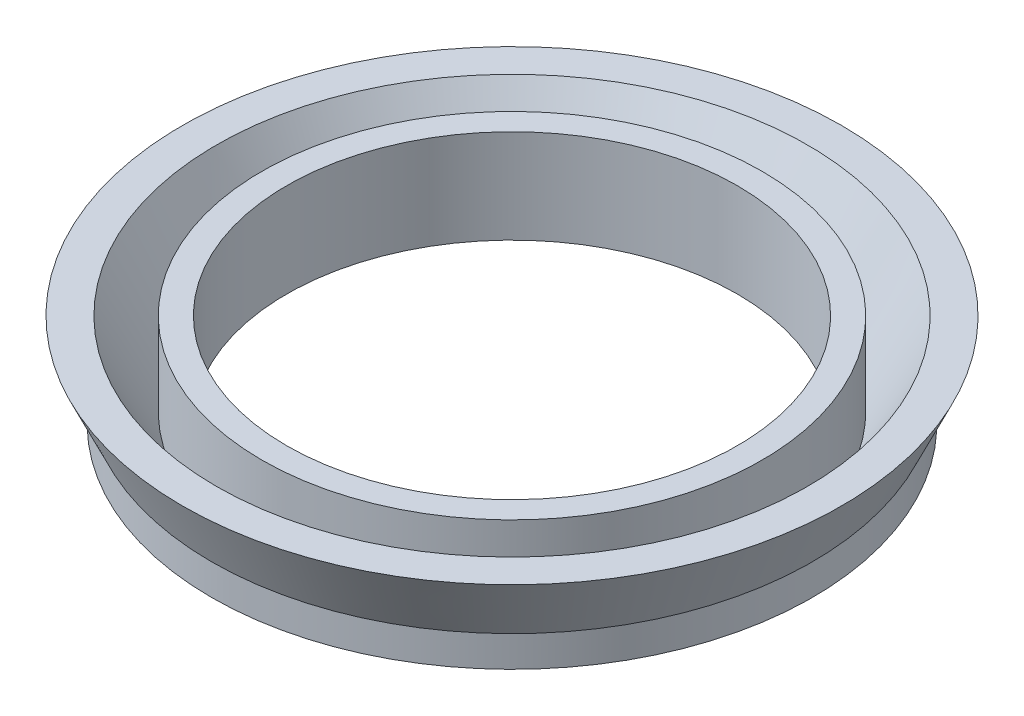
ISO-10303-21;
HEADER;
FILE_DESCRIPTION(('STEP AP214'),'2;1');
FILE_NAME('part.step','',(''),(''),'','','');
FILE_SCHEMA(('AUTOMOTIVE_DESIGN { 1 0 10303 214 1 1 1 1 }'));
ENDSEC;
DATA;
#1=APPLICATION_CONTEXT('core data for automotive mechanical design processes');
#2=APPLICATION_PROTOCOL_DEFINITION('international standard','automotive_design',2000,#1);
#3=PRODUCT_CONTEXT('',#1,'mechanical');
#4=PRODUCT('Part','Part','',(#3));
#5=PRODUCT_RELATED_PRODUCT_CATEGORY('part','',(#4));
#6=PRODUCT_DEFINITION_FORMATION('','',#4);
#7=PRODUCT_DEFINITION_CONTEXT('part definition',#1,'design');
#8=PRODUCT_DEFINITION('design','',#6,#7);
#9=PRODUCT_DEFINITION_SHAPE('','',#8);
#10=(LENGTH_UNIT() NAMED_UNIT(*) SI_UNIT(.MILLI.,.METRE.));
#11=(NAMED_UNIT(*) PLANE_ANGLE_UNIT() SI_UNIT($,.RADIAN.));
#12=(NAMED_UNIT(*) SI_UNIT($,.STERADIAN.) SOLID_ANGLE_UNIT());
#13=UNCERTAINTY_MEASURE_WITH_UNIT(LENGTH_MEASURE(1.E-05),#10,'distance_accuracy_value','');
#14=(GEOMETRIC_REPRESENTATION_CONTEXT(3) GLOBAL_UNCERTAINTY_ASSIGNED_CONTEXT((#13)) GLOBAL_UNIT_ASSIGNED_CONTEXT((#10,
#11,#12)) REPRESENTATION_CONTEXT('',''));
#15=CARTESIAN_POINT('',(0.,0.,0.));
#16=DIRECTION('',(0.,0.,1.));
#17=DIRECTION('',(1.,0.,0.));
#18=AXIS2_PLACEMENT_3D('',#15,#16,#17);
#19=CARTESIAN_POINT('',(0.,18.7428571428571,0.));
#20=DIRECTION('',(0.,1.,0.));
#21=DIRECTION('',(0.,0.,1.));
#22=AXIS2_PLACEMENT_3D('',#19,#20,#21);
#23=CYLINDRICAL_SURFACE('',#22,12.);
#24=CARTESIAN_POINT('',(0.,0.,0.));
#25=DIRECTION('',(0.,1.,0.));
#26=DIRECTION('',(0.,0.,1.));
#27=AXIS2_PLACEMENT_3D('',#24,#25,#26);
#28=CIRCLE('',#27,12.);
#29=CARTESIAN_POINT('',(0.,0.,12.));
#30=VERTEX_POINT('',#29);
#31=EDGE_CURVE('E59',#30,#30,#28,.T.);
#32=ORIENTED_EDGE('',*,*,#31,.F.);
#33=EDGE_LOOP('',(#32));
#34=FACE_BOUND('',#33,.T.);
#35=CARTESIAN_POINT('',(0.,5.,0.));
#36=DIRECTION('',(0.,1.,0.));
#37=DIRECTION('',(0.,0.,1.));
#38=AXIS2_PLACEMENT_3D('',#35,#36,#37);
#39=CIRCLE('',#38,12.);
#40=CARTESIAN_POINT('',(0.,5.,12.));
#41=VERTEX_POINT('',#40);
#42=EDGE_CURVE('E10',#41,#41,#39,.T.);
#43=ORIENTED_EDGE('',*,*,#42,.T.);
#44=EDGE_LOOP('',(#43));
#45=FACE_BOUND('',#44,.T.);
#46=ADVANCED_FACE('F31',(#34,#45),#23,.F.);
#47=CARTESIAN_POINT('',(12.,5.,0.));
#48=DIRECTION('',(0.,-1.,0.));
#49=DIRECTION('',(0.,0.,-1.));
#50=AXIS2_PLACEMENT_3D('',#47,#48,#49);
#51=PLANE('',#50);
#52=ORIENTED_EDGE('',*,*,#42,.F.);
#53=EDGE_LOOP('',(#52));
#54=FACE_BOUND('',#53,.T.);
#55=CARTESIAN_POINT('',(0.,5.,0.));
#56=DIRECTION('',(0.,1.,0.));
#57=DIRECTION('',(0.,0.,1.));
#58=AXIS2_PLACEMENT_3D('',#55,#56,#57);
#59=CIRCLE('',#58,13.3224191440759);
#60=CARTESIAN_POINT('',(0.,5.,13.3224191440759));
#61=VERTEX_POINT('',#60);
#62=EDGE_CURVE('E37',#61,#61,#59,.T.);
#63=ORIENTED_EDGE('',*,*,#62,.T.);
#64=EDGE_LOOP('',(#63));
#65=FACE_BOUND('',#64,.T.);
#66=ADVANCED_FACE('F66',(#54,#65),#51,.F.);
#67=CARTESIAN_POINT('',(0.,18.7428571428571,0.));
#68=DIRECTION('',(0.,1.,0.));
#69=DIRECTION('',(0.,0.,1.));
#70=AXIS2_PLACEMENT_3D('',#67,#68,#69);
#71=CYLINDRICAL_SURFACE('',#70,13.3224191440759);
#72=ORIENTED_EDGE('',*,*,#62,.F.);
#73=EDGE_LOOP('',(#72));
#74=FACE_BOUND('',#73,.T.);
#75=CARTESIAN_POINT('',(0.,0.563237403783234,0.));
#76=DIRECTION('',(0.,1.,0.));
#77=DIRECTION('',(0.,0.,1.));
#78=AXIS2_PLACEMENT_3D('',#75,#76,#77);
#79=CIRCLE('',#78,13.3224191440759);
#80=CARTESIAN_POINT('',(0.,0.563237403783234,13.3224191440759));
#81=VERTEX_POINT('',#80);
#82=EDGE_CURVE('E41',#81,#81,#79,.T.);
#83=ORIENTED_EDGE('',*,*,#82,.T.);
#84=EDGE_LOOP('',(#83));
#85=FACE_BOUND('',#84,.T.);
#86=ADVANCED_FACE('F70',(#74,#85),#71,.T.);
#87=CARTESIAN_POINT('',(0.,5.,0.));
#88=DIRECTION('',(0.,1.,0.));
#89=DIRECTION('',(0.,0.,1.));
#90=AXIS2_PLACEMENT_3D('',#87,#88,#89);
#91=CONICAL_SURFACE('',#90,15.7470422278368,0.50014035459895);
#92=ORIENTED_EDGE('',*,*,#82,.F.);
#93=EDGE_LOOP('',(#92));
#94=FACE_BOUND('',#93,.T.);
#95=CARTESIAN_POINT('',(0.,5.,0.));
#96=DIRECTION('',(0.,1.,0.));
#97=DIRECTION('',(0.,0.,1.));
#98=AXIS2_PLACEMENT_3D('',#95,#96,#97);
#99=CIRCLE('',#98,15.7470422278368);
#100=CARTESIAN_POINT('',(0.,5.,15.7470422278368));
#101=VERTEX_POINT('',#100);
#102=EDGE_CURVE('E45',#101,#101,#99,.T.);
#103=ORIENTED_EDGE('',*,*,#102,.T.);
#104=EDGE_LOOP('',(#103));
#105=FACE_BOUND('',#104,.T.);
#106=ADVANCED_FACE('F75',(#94,#105),#91,.F.);
#107=CARTESIAN_POINT('',(17.5524972748656,5.,0.));
#108=DIRECTION('',(0.,-1.,0.));
#109=DIRECTION('',(0.,0.,-1.));
#110=AXIS2_PLACEMENT_3D('',#107,#108,#109);
#111=PLANE('',#110);
#112=ORIENTED_EDGE('',*,*,#102,.F.);
#113=EDGE_LOOP('',(#112));
#114=FACE_BOUND('',#113,.T.);
#115=CARTESIAN_POINT('',(0.,5.,0.));
#116=DIRECTION('',(0.,1.,0.));
#117=DIRECTION('',(0.,0.,1.));
#118=AXIS2_PLACEMENT_3D('',#115,#116,#117);
#119=CIRCLE('',#118,17.5524972748656);
#120=CARTESIAN_POINT('',(0.,5.,17.5524972748656));
#121=VERTEX_POINT('',#120);
#122=EDGE_CURVE('E50',#121,#121,#119,.T.);
#123=ORIENTED_EDGE('',*,*,#122,.T.);
#124=EDGE_LOOP('',(#123));
#125=FACE_BOUND('',#124,.T.);
#126=ADVANCED_FACE('F81',(#114,#125),#111,.F.);
#127=CARTESIAN_POINT('',(0.,1.64571428571429,0.));
#128=DIRECTION('',(0.,1.,0.));
#129=DIRECTION('',(0.,0.,1.));
#130=AXIS2_PLACEMENT_3D('',#127,#128,#129);
#131=CONICAL_SURFACE('',#130,16.,0.433480139843868);
#132=ORIENTED_EDGE('',*,*,#122,.F.);
#133=EDGE_LOOP('',(#132));
#134=FACE_BOUND('',#133,.T.);
#135=CARTESIAN_POINT('',(0.,1.64571428571429,0.));
#136=DIRECTION('',(0.,1.,0.));
#137=DIRECTION('',(0.,0.,1.));
#138=AXIS2_PLACEMENT_3D('',#135,#136,#137);
#139=CIRCLE('',#138,16.);
#140=CARTESIAN_POINT('',(0.,1.64571428571429,16.));
#141=VERTEX_POINT('',#140);
#142=EDGE_CURVE('E53',#141,#141,#139,.T.);
#143=ORIENTED_EDGE('',*,*,#142,.T.);
#144=EDGE_LOOP('',(#143));
#145=FACE_BOUND('',#144,.T.);
#146=ADVANCED_FACE('F85',(#134,#145),#131,.T.);
#147=CARTESIAN_POINT('',(0.,18.7428571428571,0.));
#148=DIRECTION('',(0.,1.,0.));
#149=DIRECTION('',(0.,0.,1.));
#150=AXIS2_PLACEMENT_3D('',#147,#148,#149);
#151=CYLINDRICAL_SURFACE('',#150,16.);
#152=ORIENTED_EDGE('',*,*,#142,.F.);
#153=EDGE_LOOP('',(#152));
#154=FACE_BOUND('',#153,.T.);
#155=CARTESIAN_POINT('',(0.,0.,0.));
#156=DIRECTION('',(0.,1.,0.));
#157=DIRECTION('',(0.,0.,1.));
#158=AXIS2_PLACEMENT_3D('',#155,#156,#157);
#159=CIRCLE('',#158,16.);
#160=CARTESIAN_POINT('',(0.,0.,16.));
#161=VERTEX_POINT('',#160);
#162=EDGE_CURVE('E56',#161,#161,#159,.T.);
#163=ORIENTED_EDGE('',*,*,#162,.T.);
#164=EDGE_LOOP('',(#163));
#165=FACE_BOUND('',#164,.T.);
#166=ADVANCED_FACE('F89',(#154,#165),#151,.T.);
#167=CARTESIAN_POINT('',(12.,0.,0.));
#168=DIRECTION('',(0.,1.,0.));
#169=DIRECTION('',(0.,0.,1.));
#170=AXIS2_PLACEMENT_3D('',#167,#168,#169);
#171=PLANE('',#170);
#172=ORIENTED_EDGE('',*,*,#162,.F.);
#173=EDGE_LOOP('',(#172));
#174=FACE_BOUND('',#173,.T.);
#175=ORIENTED_EDGE('',*,*,#31,.T.);
#176=EDGE_LOOP('',(#175));
#177=FACE_BOUND('',#176,.T.);
#178=ADVANCED_FACE('F63',(#174,#177),#171,.F.);
#179=CLOSED_SHELL('',(#46,#66,#86,#106,#126,#146,#166,#178));
#180=MANIFOLD_SOLID_BREP('B2',#179);
#181=ADVANCED_BREP_SHAPE_REPRESENTATION('',(#18,#180),#14);
#182=SHAPE_DEFINITION_REPRESENTATION(#9,#181);
ENDSEC;
END-ISO-10303-21;
